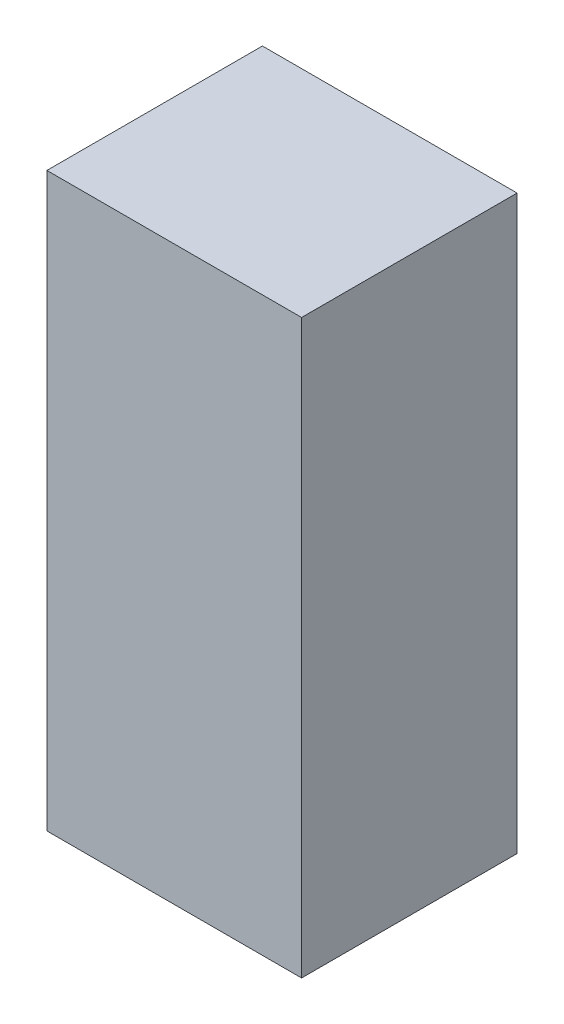
ISO-10303-21;
HEADER;
FILE_DESCRIPTION(('STEP AP214'),'2;1');
FILE_NAME('part.step','',(''),(''),'','','');
FILE_SCHEMA(('AUTOMOTIVE_DESIGN { 1 0 10303 214 1 1 1 1 }'));
ENDSEC;
DATA;
#1=APPLICATION_CONTEXT('core data for automotive mechanical design processes');
#2=APPLICATION_PROTOCOL_DEFINITION('international standard','automotive_design',2000,#1);
#3=PRODUCT_CONTEXT('',#1,'mechanical');
#4=PRODUCT('Part','Part','',(#3));
#5=PRODUCT_RELATED_PRODUCT_CATEGORY('part','',(#4));
#6=PRODUCT_DEFINITION_FORMATION('','',#4);
#7=PRODUCT_DEFINITION_CONTEXT('part definition',#1,'design');
#8=PRODUCT_DEFINITION('design','',#6,#7);
#9=PRODUCT_DEFINITION_SHAPE('','',#8);
#10=(LENGTH_UNIT() NAMED_UNIT(*) SI_UNIT(.MILLI.,.METRE.));
#11=(NAMED_UNIT(*) PLANE_ANGLE_UNIT() SI_UNIT($,.RADIAN.));
#12=(NAMED_UNIT(*) SI_UNIT($,.STERADIAN.) SOLID_ANGLE_UNIT());
#13=UNCERTAINTY_MEASURE_WITH_UNIT(LENGTH_MEASURE(1.E-05),#10,'distance_accuracy_value','');
#14=(GEOMETRIC_REPRESENTATION_CONTEXT(3) GLOBAL_UNCERTAINTY_ASSIGNED_CONTEXT((#13)) GLOBAL_UNIT_ASSIGNED_CONTEXT((#10,
#11,#12)) REPRESENTATION_CONTEXT('',''));
#15=CARTESIAN_POINT('',(0.,0.,0.));
#16=DIRECTION('',(0.,0.,1.));
#17=DIRECTION('',(1.,0.,0.));
#18=AXIS2_PLACEMENT_3D('',#15,#16,#17);
#19=CARTESIAN_POINT('',(1.269999998474E-06,0.,1.10000034));
#20=DIRECTION('',(0.,0.,1.));
#21=DIRECTION('',(1.,0.,0.));
#22=AXIS2_PLACEMENT_3D('',#19,#20,#21);
#23=PLANE('',#22);
#24=DIRECTION('',(0.,1.,0.));
#25=VECTOR('',#24,1.);
#26=CARTESIAN_POINT('',(-0.6499987,1.45999962,1.10000034));
#27=LINE('',#26,#25);
#28=CARTESIAN_POINT('',(-0.6499987,1.45999962,1.10000034));
#29=VERTEX_POINT('',#28);
#30=CARTESIAN_POINT('',(-0.6499987,-1.45999962,1.10000034));
#31=VERTEX_POINT('',#30);
#32=EDGE_CURVE('E77',#29,#31,#27,.F.);
#33=ORIENTED_EDGE('',*,*,#32,.T.);
#34=DIRECTION('',(1.,0.,0.));
#35=VECTOR('',#34,1.);
#36=CARTESIAN_POINT('',(1.269999998474E-06,-1.45999962,1.10000034));
#37=LINE('',#36,#35);
#38=CARTESIAN_POINT('',(0.65000124,-1.45999962,1.10000034));
#39=VERTEX_POINT('',#38);
#40=EDGE_CURVE('E20',#31,#39,#37,.T.);
#41=ORIENTED_EDGE('',*,*,#40,.T.);
#42=DIRECTION('',(0.,1.,0.));
#43=VECTOR('',#42,1.);
#44=CARTESIAN_POINT('',(0.65000124,-1.45999962,1.10000034));
#45=LINE('',#44,#43);
#46=CARTESIAN_POINT('',(0.65000124,1.45999962,1.10000034));
#47=VERTEX_POINT('',#46);
#48=EDGE_CURVE('E58',#39,#47,#45,.T.);
#49=ORIENTED_EDGE('',*,*,#48,.T.);
#50=DIRECTION('',(1.,0.,0.));
#51=VECTOR('',#50,1.);
#52=CARTESIAN_POINT('',(0.65000124,1.45999962,1.10000034));
#53=LINE('',#52,#51);
#54=EDGE_CURVE('E55',#47,#29,#53,.F.);
#55=ORIENTED_EDGE('',*,*,#54,.T.);
#56=EDGE_LOOP('',(#33,#41,#49,#55));
#57=FACE_BOUND('',#56,.T.);
#58=ADVANCED_FACE('F17',(#57),#23,.T.);
#59=CARTESIAN_POINT('',(0.65000124,-1.45999962,0.));
#60=DIRECTION('',(-1.,0.,0.));
#61=DIRECTION('',(0.,0.,1.));
#62=AXIS2_PLACEMENT_3D('',#59,#60,#61);
#63=PLANE('',#62);
#64=DIRECTION('',(0.,0.,-1.));
#65=VECTOR('',#64,1.);
#66=CARTESIAN_POINT('',(0.65000124,1.45999962,0.));
#67=LINE('',#66,#65);
#68=CARTESIAN_POINT('',(0.65000124,1.45999962,0.));
#69=VERTEX_POINT('',#68);
#70=EDGE_CURVE('E63',#69,#47,#67,.F.);
#71=ORIENTED_EDGE('',*,*,#70,.T.);
#72=ORIENTED_EDGE('',*,*,#48,.F.);
#73=DIRECTION('',(0.,0.,1.));
#74=VECTOR('',#73,1.);
#75=CARTESIAN_POINT('',(0.65000124,-1.45999962,0.));
#76=LINE('',#75,#74);
#77=CARTESIAN_POINT('',(0.65000124,-1.45999962,0.));
#78=VERTEX_POINT('',#77);
#79=EDGE_CURVE('E80',#39,#78,#76,.F.);
#80=ORIENTED_EDGE('',*,*,#79,.T.);
#81=DIRECTION('',(0.,1.,0.));
#82=VECTOR('',#81,1.);
#83=CARTESIAN_POINT('',(0.65000124,0.,0.));
#84=LINE('',#83,#82);
#85=EDGE_CURVE('E73',#78,#69,#84,.T.);
#86=ORIENTED_EDGE('',*,*,#85,.T.);
#87=EDGE_LOOP('',(#71,#72,#80,#86));
#88=FACE_BOUND('',#87,.T.);
#89=ADVANCED_FACE('F72',(#88),#63,.F.);
#90=CARTESIAN_POINT('',(0.65000124,1.45999962,0.));
#91=DIRECTION('',(0.,-1.,0.));
#92=DIRECTION('',(0.,0.,-1.));
#93=AXIS2_PLACEMENT_3D('',#90,#91,#92);
#94=PLANE('',#93);
#95=DIRECTION('',(0.,0.,-1.));
#96=VECTOR('',#95,1.);
#97=CARTESIAN_POINT('',(-0.6499987,1.45999962,0.));
#98=LINE('',#97,#96);
#99=CARTESIAN_POINT('',(-0.6499987,1.45999962,0.));
#100=VERTEX_POINT('',#99);
#101=EDGE_CURVE('E69',#100,#29,#98,.F.);
#102=ORIENTED_EDGE('',*,*,#101,.T.);
#103=ORIENTED_EDGE('',*,*,#54,.F.);
#104=ORIENTED_EDGE('',*,*,#70,.F.);
#105=DIRECTION('',(1.,0.,0.));
#106=VECTOR('',#105,1.);
#107=CARTESIAN_POINT('',(1.269999998474E-06,1.45999962,0.));
#108=LINE('',#107,#106);
#109=EDGE_CURVE('E83',#69,#100,#108,.F.);
#110=ORIENTED_EDGE('',*,*,#109,.T.);
#111=EDGE_LOOP('',(#102,#103,#104,#110));
#112=FACE_BOUND('',#111,.T.);
#113=ADVANCED_FACE('F66',(#112),#94,.F.);
#114=CARTESIAN_POINT('',(-0.6499987,1.45999962,0.));
#115=DIRECTION('',(1.,0.,0.));
#116=DIRECTION('',(0.,0.,-1.));
#117=AXIS2_PLACEMENT_3D('',#114,#115,#116);
#118=PLANE('',#117);
#119=DIRECTION('',(0.,0.,1.));
#120=VECTOR('',#119,1.);
#121=CARTESIAN_POINT('',(-0.6499987,-1.45999962,0.));
#122=LINE('',#121,#120);
#123=CARTESIAN_POINT('',(-0.6499987,-1.45999962,0.));
#124=VERTEX_POINT('',#123);
#125=EDGE_CURVE('E34',#124,#31,#122,.T.);
#126=ORIENTED_EDGE('',*,*,#125,.T.);
#127=ORIENTED_EDGE('',*,*,#32,.F.);
#128=ORIENTED_EDGE('',*,*,#101,.F.);
#129=DIRECTION('',(0.,1.,0.));
#130=VECTOR('',#129,1.);
#131=CARTESIAN_POINT('',(-0.6499987,0.,0.));
#132=LINE('',#131,#130);
#133=EDGE_CURVE('E26',#100,#124,#132,.F.);
#134=ORIENTED_EDGE('',*,*,#133,.T.);
#135=EDGE_LOOP('',(#126,#127,#128,#134));
#136=FACE_BOUND('',#135,.T.);
#137=ADVANCED_FACE('F88',(#136),#118,.F.);
#138=CARTESIAN_POINT('',(-0.6499987,-1.45999962,0.));
#139=DIRECTION('',(0.,1.,0.));
#140=DIRECTION('',(0.,0.,1.));
#141=AXIS2_PLACEMENT_3D('',#138,#139,#140);
#142=PLANE('',#141);
#143=ORIENTED_EDGE('',*,*,#79,.F.);
#144=ORIENTED_EDGE('',*,*,#40,.F.);
#145=ORIENTED_EDGE('',*,*,#125,.F.);
#146=DIRECTION('',(1.,0.,0.));
#147=VECTOR('',#146,1.);
#148=CARTESIAN_POINT('',(1.269999998474E-06,-1.45999962,0.));
#149=LINE('',#148,#147);
#150=EDGE_CURVE('E11',#124,#78,#149,.T.);
#151=ORIENTED_EDGE('',*,*,#150,.T.);
#152=EDGE_LOOP('',(#143,#144,#145,#151));
#153=FACE_BOUND('',#152,.T.);
#154=ADVANCED_FACE('F91',(#153),#142,.F.);
#155=CARTESIAN_POINT('',(1.269999998474E-06,0.,0.));
#156=DIRECTION('',(0.,0.,1.));
#157=DIRECTION('',(1.,0.,0.));
#158=AXIS2_PLACEMENT_3D('',#155,#156,#157);
#159=PLANE('',#158);
#160=ORIENTED_EDGE('',*,*,#133,.F.);
#161=ORIENTED_EDGE('',*,*,#109,.F.);
#162=ORIENTED_EDGE('',*,*,#85,.F.);
#163=ORIENTED_EDGE('',*,*,#150,.F.);
#164=EDGE_LOOP('',(#160,#161,#162,#163));
#165=FACE_BOUND('',#164,.T.);
#166=ADVANCED_FACE('F90',(#165),#159,.F.);
#167=CLOSED_SHELL('',(#58,#89,#113,#137,#154,#166));
#168=MANIFOLD_SOLID_BREP('B1',#167);
#169=ADVANCED_BREP_SHAPE_REPRESENTATION('',(#18,#168),#14);
#170=SHAPE_DEFINITION_REPRESENTATION(#9,#169);
ENDSEC;
END-ISO-10303-21;
